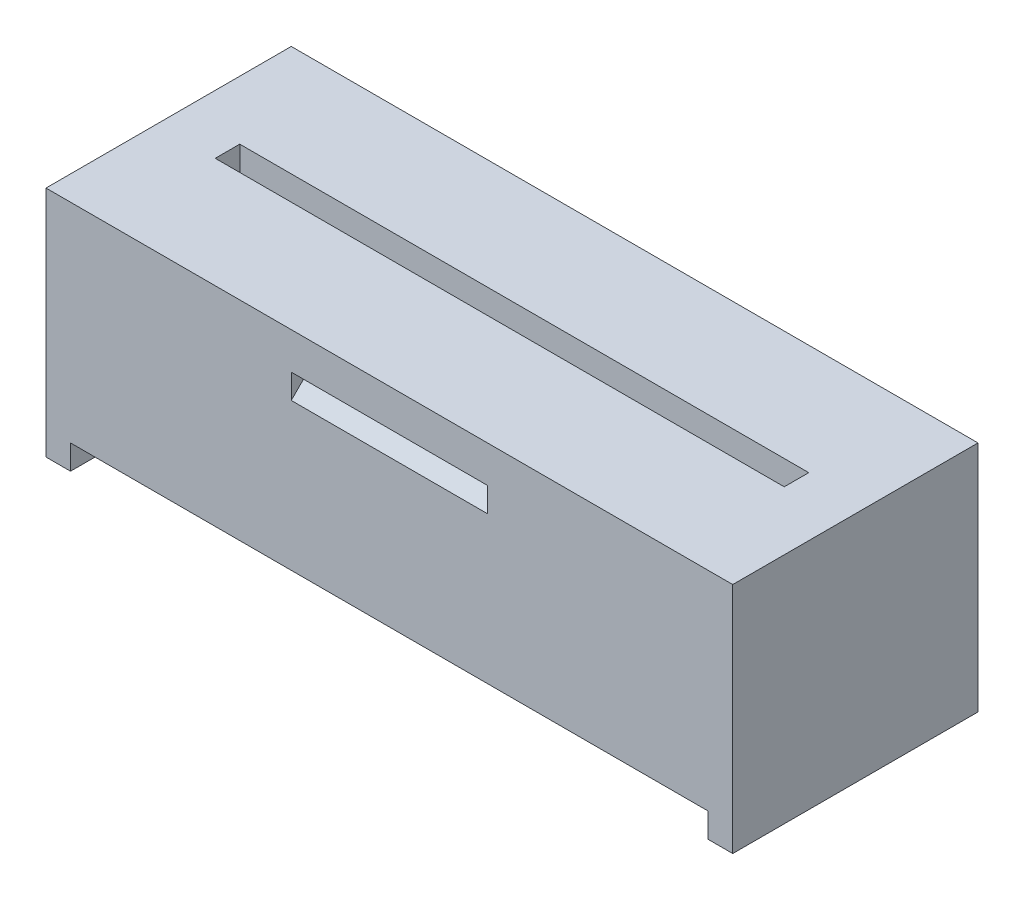
ISO-10303-21;
HEADER;
FILE_DESCRIPTION(('STEP AP214'),'2;1');
FILE_NAME('part.step','',(''),(''),'','','');
FILE_SCHEMA(('AUTOMOTIVE_DESIGN { 1 0 10303 214 1 1 1 1 }'));
ENDSEC;
DATA;
#1=APPLICATION_CONTEXT('core data for automotive mechanical design processes');
#2=APPLICATION_PROTOCOL_DEFINITION('international standard','automotive_design',2000,#1);
#3=PRODUCT_CONTEXT('',#1,'mechanical');
#4=PRODUCT('Part','Part','',(#3));
#5=PRODUCT_RELATED_PRODUCT_CATEGORY('part','',(#4));
#6=PRODUCT_DEFINITION_FORMATION('','',#4);
#7=PRODUCT_DEFINITION_CONTEXT('part definition',#1,'design');
#8=PRODUCT_DEFINITION('design','',#6,#7);
#9=PRODUCT_DEFINITION_SHAPE('','',#8);
#10=(LENGTH_UNIT() NAMED_UNIT(*) SI_UNIT(.MILLI.,.METRE.));
#11=(NAMED_UNIT(*) PLANE_ANGLE_UNIT() SI_UNIT($,.RADIAN.));
#12=(NAMED_UNIT(*) SI_UNIT($,.STERADIAN.) SOLID_ANGLE_UNIT());
#13=UNCERTAINTY_MEASURE_WITH_UNIT(LENGTH_MEASURE(1.E-05),#10,'distance_accuracy_value','');
#14=(GEOMETRIC_REPRESENTATION_CONTEXT(3) GLOBAL_UNCERTAINTY_ASSIGNED_CONTEXT((#13)) GLOBAL_UNIT_ASSIGNED_CONTEXT((#10,
#11,#12)) REPRESENTATION_CONTEXT('',''));
#15=CARTESIAN_POINT('',(0.,0.,0.));
#16=DIRECTION('',(0.,0.,1.));
#17=DIRECTION('',(1.,0.,0.));
#18=AXIS2_PLACEMENT_3D('',#15,#16,#17);
#19=CARTESIAN_POINT('',(0.,0.,0.));
#20=DIRECTION('',(0.,0.,1.));
#21=DIRECTION('',(1.,0.,0.));
#22=AXIS2_PLACEMENT_3D('',#19,#20,#21);
#23=PLANE('',#22);
#24=DIRECTION('',(0.,-1.,0.));
#25=VECTOR('',#24,1.);
#26=CARTESIAN_POINT('',(-18.6567442914303,1.7852950239775,0.));
#27=LINE('',#26,#25);
#28=CARTESIAN_POINT('',(-18.6567442914303,1.7852950239775,0.));
#29=VERTEX_POINT('',#28);
#30=CARTESIAN_POINT('',(-18.6567442914303,-7.7147049760225,0.));
#31=VERTEX_POINT('',#30);
#32=EDGE_CURVE('E346',#29,#31,#27,.T.);
#33=ORIENTED_EDGE('',*,*,#32,.T.);
#34=DIRECTION('',(1.,0.,0.));
#35=VECTOR('',#34,1.);
#36=CARTESIAN_POINT('',(-18.6567442914303,-7.7147049760225,0.));
#37=LINE('',#36,#35);
#38=CARTESIAN_POINT('',(-19.6567442914303,-7.7147049760225,0.));
#39=VERTEX_POINT('',#38);
#40=EDGE_CURVE('E274',#39,#31,#37,.T.);
#41=ORIENTED_EDGE('',*,*,#40,.F.);
#42=DIRECTION('',(0.,1.,0.));
#43=VECTOR('',#42,1.);
#44=CARTESIAN_POINT('',(-19.6567442914303,-7.7147049760225,0.));
#45=LINE('',#44,#43);
#46=CARTESIAN_POINT('',(-19.6567442914303,-6.7147049760225,0.));
#47=VERTEX_POINT('',#46);
#48=EDGE_CURVE('E277',#39,#47,#45,.T.);
#49=ORIENTED_EDGE('',*,*,#48,.T.);
#50=DIRECTION('',(1.,0.,0.));
#51=VECTOR('',#50,1.);
#52=CARTESIAN_POINT('',(-46.6567442914303,-6.7147049760225,0.));
#53=LINE('',#52,#51);
#54=CARTESIAN_POINT('',(-45.6567442914303,-6.7147049760225,0.));
#55=VERTEX_POINT('',#54);
#56=EDGE_CURVE('E387',#55,#47,#53,.T.);
#57=ORIENTED_EDGE('',*,*,#56,.F.);
#58=DIRECTION('',(0.,1.,0.));
#59=VECTOR('',#58,1.);
#60=CARTESIAN_POINT('',(-45.6567442914303,-7.7147049760225,0.));
#61=LINE('',#60,#59);
#62=CARTESIAN_POINT('',(-45.6567442914303,-7.7147049760225,0.));
#63=VERTEX_POINT('',#62);
#64=EDGE_CURVE('E301',#63,#55,#61,.T.);
#65=ORIENTED_EDGE('',*,*,#64,.F.);
#66=DIRECTION('',(1.,0.,0.));
#67=VECTOR('',#66,1.);
#68=CARTESIAN_POINT('',(-46.6567442914303,-7.7147049760225,0.));
#69=LINE('',#68,#67);
#70=CARTESIAN_POINT('',(-46.6567442914303,-7.7147049760225,0.));
#71=VERTEX_POINT('',#70);
#72=EDGE_CURVE('E289',#71,#63,#69,.T.);
#73=ORIENTED_EDGE('',*,*,#72,.F.);
#74=DIRECTION('',(0.,-1.,0.));
#75=VECTOR('',#74,1.);
#76=CARTESIAN_POINT('',(-46.6567442914303,1.7852950239775,0.));
#77=LINE('',#76,#75);
#78=CARTESIAN_POINT('',(-46.6567442914303,1.7852950239775,0.));
#79=VERTEX_POINT('',#78);
#80=EDGE_CURVE('E389',#79,#71,#77,.T.);
#81=ORIENTED_EDGE('',*,*,#80,.F.);
#82=DIRECTION('',(-1.,0.,0.));
#83=VECTOR('',#82,1.);
#84=CARTESIAN_POINT('',(-18.6567442914303,1.7852950239775,0.));
#85=LINE('',#84,#83);
#86=EDGE_CURVE('E379',#29,#79,#85,.T.);
#87=ORIENTED_EDGE('',*,*,#86,.F.);
#88=EDGE_LOOP('',(#33,#41,#49,#57,#65,#73,#81,#87));
#89=FACE_BOUND('',#88,.T.);
#90=DIRECTION('',(0.,1.,0.));
#91=VECTOR('',#90,1.);
#92=CARTESIAN_POINT('',(-36.6567442914303,-0.714704976022495,0.));
#93=LINE('',#92,#91);
#94=CARTESIAN_POINT('',(-36.6567442914303,-0.714704976022495,0.));
#95=VERTEX_POINT('',#94);
#96=CARTESIAN_POINT('',(-36.6567442914303,0.285295023977495,0.));
#97=VERTEX_POINT('',#96);
#98=EDGE_CURVE('E243',#95,#97,#93,.T.);
#99=ORIENTED_EDGE('',*,*,#98,.F.);
#100=DIRECTION('',(1.,0.,0.));
#101=VECTOR('',#100,1.);
#102=CARTESIAN_POINT('',(-36.6567442914303,-0.714704976022495,0.));
#103=LINE('',#102,#101);
#104=CARTESIAN_POINT('',(-28.6567442914303,-0.714704976022495,0.));
#105=VERTEX_POINT('',#104);
#106=EDGE_CURVE('E260',#95,#105,#103,.T.);
#107=ORIENTED_EDGE('',*,*,#106,.T.);
#108=DIRECTION('',(0.,1.,0.));
#109=VECTOR('',#108,1.);
#110=CARTESIAN_POINT('',(-28.6567442914303,-0.714704976022495,0.));
#111=LINE('',#110,#109);
#112=CARTESIAN_POINT('',(-28.6567442914303,0.285295023977495,0.));
#113=VERTEX_POINT('',#112);
#114=EDGE_CURVE('E254',#105,#113,#111,.T.);
#115=ORIENTED_EDGE('',*,*,#114,.T.);
#116=DIRECTION('',(1.,0.,0.));
#117=VECTOR('',#116,1.);
#118=CARTESIAN_POINT('',(-36.6567442914303,0.285295023977495,0.));
#119=LINE('',#118,#117);
#120=EDGE_CURVE('E253',#97,#113,#119,.T.);
#121=ORIENTED_EDGE('',*,*,#120,.F.);
#122=EDGE_LOOP('',(#99,#107,#115,#121));
#123=FACE_BOUND('',#122,.T.);
#124=ADVANCED_FACE('F33',(#89,#123),#23,.F.);
#125=CARTESIAN_POINT('',(-46.6567442914303,-6.7147049760225,10.));
#126=DIRECTION('',(0.,1.,0.));
#127=DIRECTION('',(0.,0.,1.));
#128=AXIS2_PLACEMENT_3D('',#125,#126,#127);
#129=PLANE('',#128);
#130=CARTESIAN_POINT('',(-41.6567442914303,-6.7147049760225,5.));
#131=DIRECTION('',(0.,-1.,0.));
#132=DIRECTION('',(0.,0.,-1.));
#133=AXIS2_PLACEMENT_3D('',#130,#131,#132);
#134=CIRCLE('',#133,2.6);
#135=CARTESIAN_POINT('',(-41.6567442914303,-6.7147049760225,2.4));
#136=VERTEX_POINT('',#135);
#137=EDGE_CURVE('E349',#136,#136,#134,.T.);
#138=ORIENTED_EDGE('',*,*,#137,.F.);
#139=EDGE_LOOP('',(#138));
#140=FACE_BOUND('',#139,.T.);
#141=CARTESIAN_POINT('',(-35.6467442914303,-6.7147049760225,5.00000000000004));
#142=DIRECTION('',(0.,-1.,0.));
#143=DIRECTION('',(0.,0.,-1.));
#144=AXIS2_PLACEMENT_3D('',#141,#142,#143);
#145=CIRCLE('',#144,2.6);
#146=CARTESIAN_POINT('',(-35.6467442914303,-6.7147049760225,2.40000000000004));
#147=VERTEX_POINT('',#146);
#148=EDGE_CURVE('E356',#147,#147,#145,.T.);
#149=ORIENTED_EDGE('',*,*,#148,.F.);
#150=EDGE_LOOP('',(#149));
#151=FACE_BOUND('',#150,.T.);
#152=CARTESIAN_POINT('',(-29.6367442914303,-6.7147049760225,5.00000000000008));
#153=DIRECTION('',(0.,-1.,0.));
#154=DIRECTION('',(0.,0.,-1.));
#155=AXIS2_PLACEMENT_3D('',#152,#153,#154);
#156=CIRCLE('',#155,2.6);
#157=CARTESIAN_POINT('',(-29.6367442914303,-6.7147049760225,2.40000000000008));
#158=VERTEX_POINT('',#157);
#159=EDGE_CURVE('E364',#158,#158,#156,.T.);
#160=ORIENTED_EDGE('',*,*,#159,.F.);
#161=EDGE_LOOP('',(#160));
#162=FACE_BOUND('',#161,.T.);
#163=CARTESIAN_POINT('',(-23.6267442914303,-6.7147049760225,5.00000000000013));
#164=DIRECTION('',(0.,-1.,0.));
#165=DIRECTION('',(0.,0.,-1.));
#166=AXIS2_PLACEMENT_3D('',#163,#164,#165);
#167=CIRCLE('',#166,2.6);
#168=CARTESIAN_POINT('',(-23.6267442914303,-6.7147049760225,2.40000000000013));
#169=VERTEX_POINT('',#168);
#170=EDGE_CURVE('E372',#169,#169,#167,.T.);
#171=ORIENTED_EDGE('',*,*,#170,.F.);
#172=EDGE_LOOP('',(#171));
#173=FACE_BOUND('',#172,.T.);
#174=DIRECTION('',(0.,0.,-1.));
#175=VECTOR('',#174,1.);
#176=CARTESIAN_POINT('',(-19.6567442914303,-6.7147049760225,10.));
#177=LINE('',#176,#175);
#178=CARTESIAN_POINT('',(-19.6567442914303,-6.7147049760225,10.));
#179=VERTEX_POINT('',#178);
#180=EDGE_CURVE('E270',#179,#47,#177,.T.);
#181=ORIENTED_EDGE('',*,*,#180,.F.);
#182=DIRECTION('',(1.,0.,0.));
#183=VECTOR('',#182,1.);
#184=CARTESIAN_POINT('',(-46.6567442914303,-6.7147049760225,10.));
#185=LINE('',#184,#183);
#186=CARTESIAN_POINT('',(-45.6567442914303,-6.7147049760225,10.));
#187=VERTEX_POINT('',#186);
#188=EDGE_CURVE('E378',#187,#179,#185,.T.);
#189=ORIENTED_EDGE('',*,*,#188,.F.);
#190=DIRECTION('',(0.,0.,1.));
#191=VECTOR('',#190,1.);
#192=CARTESIAN_POINT('',(-45.6567442914303,-6.7147049760225,10.));
#193=LINE('',#192,#191);
#194=EDGE_CURVE('E285',#55,#187,#193,.T.);
#195=ORIENTED_EDGE('',*,*,#194,.F.);
#196=ORIENTED_EDGE('',*,*,#56,.T.);
#197=EDGE_LOOP('',(#181,#189,#195,#196));
#198=FACE_BOUND('',#197,.T.);
#199=ADVANCED_FACE('F428',(#140,#151,#162,#173,#198),#129,.F.);
#200=CARTESIAN_POINT('',(-23.6267442914303,0.785295023977495,5.00000000000013));
#201=DIRECTION('',(0.,-1.,0.));
#202=DIRECTION('',(0.,0.,-1.));
#203=AXIS2_PLACEMENT_3D('',#200,#201,#202);
#204=PLANE('',#203);
#205=CARTESIAN_POINT('',(-23.6267442914303,0.785295023977495,5.00000000000013));
#206=DIRECTION('',(0.,-1.,0.));
#207=DIRECTION('',(0.,0.,-1.));
#208=AXIS2_PLACEMENT_3D('',#205,#206,#207);
#209=CIRCLE('',#208,2.6);
#210=CARTESIAN_POINT('',(-21.0567442914303,0.785295023977499,4.60617262664985));
#211=VERTEX_POINT('',#210);
#212=CARTESIAN_POINT('',(-21.0567442914303,0.785295023977499,5.39382737335041));
#213=VERTEX_POINT('',#212);
#214=EDGE_CURVE('E369',#211,#213,#209,.T.);
#215=ORIENTED_EDGE('',*,*,#214,.T.);
#216=DIRECTION('',(0.,0.,-1.));
#217=VECTOR('',#216,1.);
#218=CARTESIAN_POINT('',(-21.0567442914303,0.785295023977499,4.5));
#219=LINE('',#218,#217);
#220=EDGE_CURVE('E309',#213,#211,#219,.T.);
#221=ORIENTED_EDGE('',*,*,#220,.T.);
#222=EDGE_LOOP('',(#215,#221));
#223=FACE_BOUND('',#222,.T.);
#224=ADVANCED_FACE('F430',(#223),#204,.T.);
#225=CARTESIAN_POINT('',(-21.0752741269957,0.785295023977499,5.5));
#226=VERTEX_POINT('',#225);
#227=CARTESIAN_POINT('',(-26.178214455865,0.785295023977498,5.5));
#228=VERTEX_POINT('',#227);
#229=EDGE_CURVE('E875',#226,#228,#209,.T.);
#230=ORIENTED_EDGE('',*,*,#229,.T.);
#231=DIRECTION('',(1.,0.,0.));
#232=VECTOR('',#231,1.);
#233=CARTESIAN_POINT('',(-44.2567442914303,0.785295023977495,5.5));
#234=LINE('',#233,#232);
#235=EDGE_CURVE('E905',#228,#226,#234,.T.);
#236=ORIENTED_EDGE('',*,*,#235,.T.);
#237=EDGE_LOOP('',(#230,#236));
#238=FACE_BOUND('',#237,.T.);
#239=ADVANCED_FACE('F436',(#238),#204,.T.);
#240=CARTESIAN_POINT('',(-26.1782144558649,0.785295023977494,4.5));
#241=VERTEX_POINT('',#240);
#242=CARTESIAN_POINT('',(-21.0752741269957,0.785295023977499,4.5));
#243=VERTEX_POINT('',#242);
#244=EDGE_CURVE('E370',#241,#243,#209,.T.);
#245=ORIENTED_EDGE('',*,*,#244,.T.);
#246=DIRECTION('',(-1.,0.,0.));
#247=VECTOR('',#246,1.);
#248=CARTESIAN_POINT('',(-44.2567442914303,0.785295023977495,4.5));
#249=LINE('',#248,#247);
#250=EDGE_CURVE('E315',#243,#241,#249,.T.);
#251=ORIENTED_EDGE('',*,*,#250,.T.);
#252=EDGE_LOOP('',(#245,#251));
#253=FACE_BOUND('',#252,.T.);
#254=ADVANCED_FACE('F439',(#253),#204,.T.);
#255=CARTESIAN_POINT('',(-29.6367442914303,0.785295023977495,5.00000000000008));
#256=DIRECTION('',(0.,-1.,0.));
#257=DIRECTION('',(0.,0.,-1.));
#258=AXIS2_PLACEMENT_3D('',#255,#256,#257);
#259=PLANE('',#258);
#260=CARTESIAN_POINT('',(-29.6367442914303,0.785295023977495,5.00000000000008));
#261=DIRECTION('',(0.,-1.,0.));
#262=DIRECTION('',(0.,0.,-1.));
#263=AXIS2_PLACEMENT_3D('',#260,#261,#262);
#264=CIRCLE('',#263,2.6);
#265=CARTESIAN_POINT('',(-27.0852741269957,0.785295023977498,5.5));
#266=VERTEX_POINT('',#265);
#267=CARTESIAN_POINT('',(-32.188214455865,0.785295023977497,5.5));
#268=VERTEX_POINT('',#267);
#269=EDGE_CURVE('E361',#266,#268,#264,.T.);
#270=ORIENTED_EDGE('',*,*,#269,.T.);
#271=EDGE_CURVE('E903',#268,#266,#234,.T.);
#272=ORIENTED_EDGE('',*,*,#271,.T.);
#273=EDGE_LOOP('',(#270,#272));
#274=FACE_BOUND('',#273,.T.);
#275=ADVANCED_FACE('F460',(#274),#259,.T.);
#276=CARTESIAN_POINT('',(-32.1882144558649,0.785295023977494,4.5));
#277=VERTEX_POINT('',#276);
#278=CARTESIAN_POINT('',(-27.0852741269957,0.785295023977498,4.5));
#279=VERTEX_POINT('',#278);
#280=EDGE_CURVE('E362',#277,#279,#264,.T.);
#281=ORIENTED_EDGE('',*,*,#280,.T.);
#282=EDGE_CURVE('E898',#279,#277,#249,.T.);
#283=ORIENTED_EDGE('',*,*,#282,.T.);
#284=EDGE_LOOP('',(#281,#283));
#285=FACE_BOUND('',#284,.T.);
#286=ADVANCED_FACE('F463',(#285),#259,.T.);
#287=CARTESIAN_POINT('',(-35.6467442914303,0.785295023977495,5.00000000000004));
#288=DIRECTION('',(0.,-1.,0.));
#289=DIRECTION('',(0.,0.,-1.));
#290=AXIS2_PLACEMENT_3D('',#287,#288,#289);
#291=PLANE('',#290);
#292=CARTESIAN_POINT('',(-35.6467442914303,0.785295023977495,5.00000000000004));
#293=DIRECTION('',(0.,-1.,0.));
#294=DIRECTION('',(0.,0.,-1.));
#295=AXIS2_PLACEMENT_3D('',#292,#293,#294);
#296=CIRCLE('',#295,2.6);
#297=CARTESIAN_POINT('',(-33.0952741269957,0.785295023977497,5.5));
#298=VERTEX_POINT('',#297);
#299=CARTESIAN_POINT('',(-38.1982144558649,0.785295023977496,5.5));
#300=VERTEX_POINT('',#299);
#301=EDGE_CURVE('E354',#298,#300,#296,.T.);
#302=ORIENTED_EDGE('',*,*,#301,.T.);
#303=EDGE_CURVE('E854',#300,#298,#234,.T.);
#304=ORIENTED_EDGE('',*,*,#303,.T.);
#305=EDGE_LOOP('',(#302,#304));
#306=FACE_BOUND('',#305,.T.);
#307=ADVANCED_FACE('F469',(#306),#291,.T.);
#308=CARTESIAN_POINT('',(-38.1982144558649,0.785295023977494,4.5));
#309=VERTEX_POINT('',#308);
#310=CARTESIAN_POINT('',(-33.0952741269957,0.785295023977497,4.5));
#311=VERTEX_POINT('',#310);
#312=EDGE_CURVE('E355',#309,#311,#296,.T.);
#313=ORIENTED_EDGE('',*,*,#312,.T.);
#314=EDGE_CURVE('E914',#311,#309,#249,.T.);
#315=ORIENTED_EDGE('',*,*,#314,.T.);
#316=EDGE_LOOP('',(#313,#315));
#317=FACE_BOUND('',#316,.T.);
#318=ADVANCED_FACE('F472',(#317),#291,.T.);
#319=CARTESIAN_POINT('',(-41.6567442914303,0.785295023977495,5.));
#320=DIRECTION('',(0.,-1.,0.));
#321=DIRECTION('',(0.,0.,-1.));
#322=AXIS2_PLACEMENT_3D('',#319,#320,#321);
#323=PLANE('',#322);
#324=CARTESIAN_POINT('',(-41.6567442914303,0.785295023977495,5.));
#325=DIRECTION('',(0.,-1.,0.));
#326=DIRECTION('',(0.,0.,-1.));
#327=AXIS2_PLACEMENT_3D('',#324,#325,#326);
#328=CIRCLE('',#327,2.6);
#329=CARTESIAN_POINT('',(-39.1052741269957,0.785295023977496,5.5));
#330=VERTEX_POINT('',#329);
#331=CARTESIAN_POINT('',(-44.2082144558649,0.785295023977495,5.5));
#332=VERTEX_POINT('',#331);
#333=EDGE_CURVE('E347',#330,#332,#328,.T.);
#334=ORIENTED_EDGE('',*,*,#333,.T.);
#335=EDGE_CURVE('E324',#332,#330,#234,.T.);
#336=ORIENTED_EDGE('',*,*,#335,.T.);
#337=EDGE_LOOP('',(#334,#336));
#338=FACE_BOUND('',#337,.T.);
#339=ADVANCED_FACE('F478',(#338),#323,.T.);
#340=CARTESIAN_POINT('',(-44.2082144558649,0.785295023977494,4.5));
#341=VERTEX_POINT('',#340);
#342=CARTESIAN_POINT('',(-39.1052741269957,0.785295023977496,4.5));
#343=VERTEX_POINT('',#342);
#344=EDGE_CURVE('E348',#341,#343,#328,.T.);
#345=ORIENTED_EDGE('',*,*,#344,.T.);
#346=EDGE_CURVE('E836',#343,#341,#249,.T.);
#347=ORIENTED_EDGE('',*,*,#346,.T.);
#348=EDGE_LOOP('',(#345,#347));
#349=FACE_BOUND('',#348,.T.);
#350=ADVANCED_FACE('F481',(#349),#323,.T.);
#351=CARTESIAN_POINT('',(-18.6567442914303,1.7852950239775,10.));
#352=DIRECTION('',(1.,0.,0.));
#353=DIRECTION('',(0.,0.,-1.));
#354=AXIS2_PLACEMENT_3D('',#351,#352,#353);
#355=PLANE('',#354);
#356=ORIENTED_EDGE('',*,*,#32,.F.);
#357=DIRECTION('',(0.,0.,-1.));
#358=VECTOR('',#357,1.);
#359=CARTESIAN_POINT('',(-18.6567442914303,1.7852950239775,10.));
#360=LINE('',#359,#358);
#361=CARTESIAN_POINT('',(-18.6567442914303,1.7852950239775,10.));
#362=VERTEX_POINT('',#361);
#363=EDGE_CURVE('E11',#362,#29,#360,.T.);
#364=ORIENTED_EDGE('',*,*,#363,.F.);
#365=DIRECTION('',(0.,-1.,0.));
#366=VECTOR('',#365,1.);
#367=CARTESIAN_POINT('',(-18.6567442914303,1.7852950239775,10.));
#368=LINE('',#367,#366);
#369=CARTESIAN_POINT('',(-18.6567442914303,-7.7147049760225,10.));
#370=VERTEX_POINT('',#369);
#371=EDGE_CURVE('E376',#362,#370,#368,.T.);
#372=ORIENTED_EDGE('',*,*,#371,.T.);
#373=DIRECTION('',(0.,0.,1.));
#374=VECTOR('',#373,1.);
#375=CARTESIAN_POINT('',(-18.6567442914303,-7.7147049760225,10.));
#376=LINE('',#375,#374);
#377=EDGE_CURVE('E266',#31,#370,#376,.T.);
#378=ORIENTED_EDGE('',*,*,#377,.F.);
#379=EDGE_LOOP('',(#356,#364,#372,#378));
#380=FACE_BOUND('',#379,.T.);
#381=ADVANCED_FACE('F35',(#380),#355,.T.);
#382=CARTESIAN_POINT('',(-18.6567442914303,1.7852950239775,10.));
#383=DIRECTION('',(0.,-1.,0.));
#384=DIRECTION('',(1.,0.,0.));
#385=AXIS2_PLACEMENT_3D('',#382,#383,#384);
#386=PLANE('',#385);
#387=DIRECTION('',(-1.,0.,0.));
#388=VECTOR('',#387,1.);
#389=CARTESIAN_POINT('',(-44.2567442914303,1.7852950239775,4.5));
#390=LINE('',#389,#388);
#391=CARTESIAN_POINT('',(-21.0567442914303,1.7852950239775,4.5));
#392=VERTEX_POINT('',#391);
#393=CARTESIAN_POINT('',(-44.2567442914303,1.7852950239775,4.5));
#394=VERTEX_POINT('',#393);
#395=EDGE_CURVE('E326',#392,#394,#390,.T.);
#396=ORIENTED_EDGE('',*,*,#395,.F.);
#397=DIRECTION('',(0.,0.,-1.));
#398=VECTOR('',#397,1.);
#399=CARTESIAN_POINT('',(-21.0567442914303,1.7852950239775,4.5));
#400=LINE('',#399,#398);
#401=CARTESIAN_POINT('',(-21.0567442914303,1.7852950239775,5.5));
#402=VERTEX_POINT('',#401);
#403=EDGE_CURVE('E304',#402,#392,#400,.T.);
#404=ORIENTED_EDGE('',*,*,#403,.F.);
#405=DIRECTION('',(1.,0.,0.));
#406=VECTOR('',#405,1.);
#407=CARTESIAN_POINT('',(-44.2567442914303,1.7852950239775,5.5));
#408=LINE('',#407,#406);
#409=CARTESIAN_POINT('',(-44.2567442914303,1.7852950239775,5.5));
#410=VERTEX_POINT('',#409);
#411=EDGE_CURVE('E332',#410,#402,#408,.T.);
#412=ORIENTED_EDGE('',*,*,#411,.F.);
#413=DIRECTION('',(0.,0.,1.));
#414=VECTOR('',#413,1.);
#415=CARTESIAN_POINT('',(-44.2567442914303,1.7852950239775,4.5));
#416=LINE('',#415,#414);
#417=EDGE_CURVE('E329',#394,#410,#416,.T.);
#418=ORIENTED_EDGE('',*,*,#417,.F.);
#419=EDGE_LOOP('',(#396,#404,#412,#418));
#420=FACE_BOUND('',#419,.T.);
#421=ORIENTED_EDGE('',*,*,#86,.T.);
#422=DIRECTION('',(0.,0.,-1.));
#423=VECTOR('',#422,1.);
#424=CARTESIAN_POINT('',(-46.6567442914303,1.7852950239775,10.));
#425=LINE('',#424,#423);
#426=CARTESIAN_POINT('',(-46.6567442914303,1.7852950239775,10.));
#427=VERTEX_POINT('',#426);
#428=EDGE_CURVE('E37',#427,#79,#425,.T.);
#429=ORIENTED_EDGE('',*,*,#428,.F.);
#430=DIRECTION('',(-1.,0.,0.));
#431=VECTOR('',#430,1.);
#432=CARTESIAN_POINT('',(-18.6567442914303,1.7852950239775,10.));
#433=LINE('',#432,#431);
#434=EDGE_CURVE('E384',#362,#427,#433,.T.);
#435=ORIENTED_EDGE('',*,*,#434,.F.);
#436=ORIENTED_EDGE('',*,*,#363,.T.);
#437=EDGE_LOOP('',(#421,#429,#435,#436));
#438=FACE_BOUND('',#437,.T.);
#439=ADVANCED_FACE('F395',(#420,#438),#386,.F.);
#440=CARTESIAN_POINT('',(-46.6567442914303,1.7852950239775,10.));
#441=DIRECTION('',(1.,0.,0.));
#442=DIRECTION('',(0.,0.,-1.));
#443=AXIS2_PLACEMENT_3D('',#440,#441,#442);
#444=PLANE('',#443);
#445=ORIENTED_EDGE('',*,*,#80,.T.);
#446=DIRECTION('',(0.,0.,-1.));
#447=VECTOR('',#446,1.);
#448=CARTESIAN_POINT('',(-46.6567442914303,-7.7147049760225,10.));
#449=LINE('',#448,#447);
#450=CARTESIAN_POINT('',(-46.6567442914303,-7.7147049760225,10.));
#451=VERTEX_POINT('',#450);
#452=EDGE_CURVE('E286',#451,#71,#449,.T.);
#453=ORIENTED_EDGE('',*,*,#452,.F.);
#454=DIRECTION('',(0.,-1.,0.));
#455=VECTOR('',#454,1.);
#456=CARTESIAN_POINT('',(-46.6567442914303,1.7852950239775,10.));
#457=LINE('',#456,#455);
#458=EDGE_CURVE('E382',#427,#451,#457,.T.);
#459=ORIENTED_EDGE('',*,*,#458,.F.);
#460=ORIENTED_EDGE('',*,*,#428,.T.);
#461=EDGE_LOOP('',(#445,#453,#459,#460));
#462=FACE_BOUND('',#461,.T.);
#463=ADVANCED_FACE('F402',(#462),#444,.F.);
#464=CARTESIAN_POINT('',(0.,0.,10.));
#465=DIRECTION('',(0.,0.,1.));
#466=DIRECTION('',(1.,0.,0.));
#467=AXIS2_PLACEMENT_3D('',#464,#465,#466);
#468=PLANE('',#467);
#469=DIRECTION('',(0.,-1.,0.));
#470=VECTOR('',#469,1.);
#471=CARTESIAN_POINT('',(-36.6567442914303,-0.714704976022505,10.));
#472=LINE('',#471,#470);
#473=CARTESIAN_POINT('',(-36.6567442914303,0.285295023977495,10.));
#474=VERTEX_POINT('',#473);
#475=CARTESIAN_POINT('',(-36.6567442914303,-0.714704976022505,10.));
#476=VERTEX_POINT('',#475);
#477=EDGE_CURVE('E226',#474,#476,#472,.T.);
#478=ORIENTED_EDGE('',*,*,#477,.F.);
#479=DIRECTION('',(1.,0.,0.));
#480=VECTOR('',#479,1.);
#481=CARTESIAN_POINT('',(-36.6567442914303,0.285295023977495,10.));
#482=LINE('',#481,#480);
#483=CARTESIAN_POINT('',(-28.6567442914303,0.285295023977495,10.));
#484=VERTEX_POINT('',#483);
#485=EDGE_CURVE('E238',#474,#484,#482,.T.);
#486=ORIENTED_EDGE('',*,*,#485,.T.);
#487=DIRECTION('',(0.,-1.,0.));
#488=VECTOR('',#487,1.);
#489=CARTESIAN_POINT('',(-28.6567442914303,-0.714704976022505,10.));
#490=LINE('',#489,#488);
#491=CARTESIAN_POINT('',(-28.6567442914303,-0.714704976022505,10.));
#492=VERTEX_POINT('',#491);
#493=EDGE_CURVE('E236',#484,#492,#490,.T.);
#494=ORIENTED_EDGE('',*,*,#493,.T.);
#495=DIRECTION('',(1.,0.,0.));
#496=VECTOR('',#495,1.);
#497=CARTESIAN_POINT('',(-36.6567442914303,-0.714704976022505,10.));
#498=LINE('',#497,#496);
#499=EDGE_CURVE('E219',#476,#492,#498,.T.);
#500=ORIENTED_EDGE('',*,*,#499,.F.);
#501=EDGE_LOOP('',(#478,#486,#494,#500));
#502=FACE_BOUND('',#501,.T.);
#503=ORIENTED_EDGE('',*,*,#371,.F.);
#504=ORIENTED_EDGE('',*,*,#434,.T.);
#505=ORIENTED_EDGE('',*,*,#458,.T.);
#506=DIRECTION('',(-1.,0.,0.));
#507=VECTOR('',#506,1.);
#508=CARTESIAN_POINT('',(-46.6567442914303,-7.7147049760225,10.));
#509=LINE('',#508,#507);
#510=CARTESIAN_POINT('',(-45.6567442914303,-7.7147049760225,10.));
#511=VERTEX_POINT('',#510);
#512=EDGE_CURVE('E293',#511,#451,#509,.T.);
#513=ORIENTED_EDGE('',*,*,#512,.F.);
#514=DIRECTION('',(0.,1.,0.));
#515=VECTOR('',#514,1.);
#516=CARTESIAN_POINT('',(-45.6567442914303,-7.7147049760225,10.));
#517=LINE('',#516,#515);
#518=EDGE_CURVE('E296',#511,#187,#517,.T.);
#519=ORIENTED_EDGE('',*,*,#518,.T.);
#520=ORIENTED_EDGE('',*,*,#188,.T.);
#521=DIRECTION('',(0.,1.,0.));
#522=VECTOR('',#521,1.);
#523=CARTESIAN_POINT('',(-19.6567442914303,-7.7147049760225,10.));
#524=LINE('',#523,#522);
#525=CARTESIAN_POINT('',(-19.6567442914303,-7.7147049760225,10.));
#526=VERTEX_POINT('',#525);
#527=EDGE_CURVE('E282',#526,#179,#524,.T.);
#528=ORIENTED_EDGE('',*,*,#527,.F.);
#529=DIRECTION('',(-1.,0.,0.));
#530=VECTOR('',#529,1.);
#531=CARTESIAN_POINT('',(-18.6567442914303,-7.7147049760225,10.));
#532=LINE('',#531,#530);
#533=EDGE_CURVE('E269',#370,#526,#532,.T.);
#534=ORIENTED_EDGE('',*,*,#533,.F.);
#535=EDGE_LOOP('',(#503,#504,#505,#513,#519,#520,#528,#534));
#536=FACE_BOUND('',#535,.T.);
#537=ADVANCED_FACE('F234',(#502,#536),#468,.T.);
#538=CARTESIAN_POINT('',(-23.6267442914303,0.785295023977495,5.00000000000013));
#539=DIRECTION('',(0.,-1.,0.));
#540=DIRECTION('',(0.,0.,-1.));
#541=AXIS2_PLACEMENT_3D('',#538,#539,#540);
#542=CYLINDRICAL_SURFACE('',#541,2.6);
#543=EDGE_CURVE('E367',#243,#211,#209,.T.);
#544=ORIENTED_EDGE('',*,*,#543,.F.);
#545=ORIENTED_EDGE('',*,*,#244,.F.);
#546=EDGE_CURVE('E371',#228,#241,#209,.T.);
#547=ORIENTED_EDGE('',*,*,#546,.F.);
#548=ORIENTED_EDGE('',*,*,#229,.F.);
#549=EDGE_CURVE('E375',#213,#226,#209,.T.);
#550=ORIENTED_EDGE('',*,*,#549,.F.);
#551=ORIENTED_EDGE('',*,*,#214,.F.);
#552=EDGE_LOOP('',(#544,#545,#547,#548,#550,#551));
#553=FACE_BOUND('',#552,.T.);
#554=ORIENTED_EDGE('',*,*,#170,.T.);
#555=EDGE_LOOP('',(#554));
#556=FACE_BOUND('',#555,.T.);
#557=ADVANCED_FACE('F451',(#553,#556),#542,.F.);
#558=CARTESIAN_POINT('',(-29.6367442914303,0.785295023977495,5.00000000000008));
#559=DIRECTION('',(0.,-1.,0.));
#560=DIRECTION('',(0.,0.,-1.));
#561=AXIS2_PLACEMENT_3D('',#558,#559,#560);
#562=CYLINDRICAL_SURFACE('',#561,2.6);
#563=EDGE_CURVE('E359',#279,#266,#264,.T.);
#564=ORIENTED_EDGE('',*,*,#563,.F.);
#565=ORIENTED_EDGE('',*,*,#280,.F.);
#566=EDGE_CURVE('E363',#268,#277,#264,.T.);
#567=ORIENTED_EDGE('',*,*,#566,.F.);
#568=ORIENTED_EDGE('',*,*,#269,.F.);
#569=EDGE_LOOP('',(#564,#565,#567,#568));
#570=FACE_BOUND('',#569,.T.);
#571=ORIENTED_EDGE('',*,*,#159,.T.);
#572=EDGE_LOOP('',(#571));
#573=FACE_BOUND('',#572,.T.);
#574=ADVANCED_FACE('F453',(#570,#573),#562,.F.);
#575=CARTESIAN_POINT('',(-35.6467442914303,0.785295023977495,5.00000000000004));
#576=DIRECTION('',(0.,-1.,0.));
#577=DIRECTION('',(0.,0.,-1.));
#578=AXIS2_PLACEMENT_3D('',#575,#576,#577);
#579=CYLINDRICAL_SURFACE('',#578,2.6);
#580=EDGE_CURVE('E352',#311,#298,#296,.T.);
#581=ORIENTED_EDGE('',*,*,#580,.F.);
#582=ORIENTED_EDGE('',*,*,#312,.F.);
#583=EDGE_CURVE('E337',#300,#309,#296,.T.);
#584=ORIENTED_EDGE('',*,*,#583,.F.);
#585=ORIENTED_EDGE('',*,*,#301,.F.);
#586=EDGE_LOOP('',(#581,#582,#584,#585));
#587=FACE_BOUND('',#586,.T.);
#588=ORIENTED_EDGE('',*,*,#148,.T.);
#589=EDGE_LOOP('',(#588));
#590=FACE_BOUND('',#589,.T.);
#591=ADVANCED_FACE('F458',(#587,#590),#579,.F.);
#592=CARTESIAN_POINT('',(-41.6567442914303,0.785295023977495,5.));
#593=DIRECTION('',(0.,-1.,0.));
#594=DIRECTION('',(0.,0.,-1.));
#595=AXIS2_PLACEMENT_3D('',#592,#593,#594);
#596=CYLINDRICAL_SURFACE('',#595,2.6);
#597=EDGE_CURVE('E344',#343,#330,#328,.T.);
#598=ORIENTED_EDGE('',*,*,#597,.F.);
#599=ORIENTED_EDGE('',*,*,#344,.F.);
#600=CARTESIAN_POINT('',(-44.2567442914303,0.785295023977495,5.));
#601=VERTEX_POINT('',#600);
#602=EDGE_CURVE('E838',#601,#341,#328,.T.);
#603=ORIENTED_EDGE('',*,*,#602,.F.);
#604=EDGE_CURVE('E855',#332,#601,#328,.T.);
#605=ORIENTED_EDGE('',*,*,#604,.F.);
#606=ORIENTED_EDGE('',*,*,#333,.F.);
#607=EDGE_LOOP('',(#598,#599,#603,#605,#606));
#608=FACE_BOUND('',#607,.T.);
#609=ORIENTED_EDGE('',*,*,#137,.T.);
#610=EDGE_LOOP('',(#609));
#611=FACE_BOUND('',#610,.T.);
#612=ADVANCED_FACE('F467',(#608,#611),#596,.F.);
#613=CARTESIAN_POINT('',(0.,0.785295023977501,0.));
#614=DIRECTION('',(0.,1.,0.));
#615=DIRECTION('',(-1.,0.,0.));
#616=AXIS2_PLACEMENT_3D('',#613,#614,#615);
#617=PLANE('',#616);
#618=ORIENTED_EDGE('',*,*,#543,.T.);
#619=CARTESIAN_POINT('',(-21.0567442914303,0.785295023977499,4.5));
#620=VERTEX_POINT('',#619);
#621=EDGE_CURVE('E310',#211,#620,#219,.T.);
#622=ORIENTED_EDGE('',*,*,#621,.T.);
#623=EDGE_CURVE('E311',#620,#243,#249,.T.);
#624=ORIENTED_EDGE('',*,*,#623,.T.);
#625=EDGE_LOOP('',(#618,#622,#624));
#626=FACE_BOUND('',#625,.T.);
#627=ADVANCED_FACE('F476',(#626),#617,.T.);
#628=ORIENTED_EDGE('',*,*,#549,.T.);
#629=CARTESIAN_POINT('',(-21.0567442914303,0.785295023977499,5.5));
#630=VERTEX_POINT('',#629);
#631=EDGE_CURVE('E319',#226,#630,#234,.T.);
#632=ORIENTED_EDGE('',*,*,#631,.T.);
#633=EDGE_CURVE('E305',#630,#213,#219,.T.);
#634=ORIENTED_EDGE('',*,*,#633,.T.);
#635=EDGE_LOOP('',(#628,#632,#634));
#636=FACE_BOUND('',#635,.T.);
#637=ADVANCED_FACE('F502',(#636),#617,.T.);
#638=ORIENTED_EDGE('',*,*,#546,.T.);
#639=EDGE_CURVE('E902',#241,#279,#249,.T.);
#640=ORIENTED_EDGE('',*,*,#639,.T.);
#641=ORIENTED_EDGE('',*,*,#563,.T.);
#642=EDGE_CURVE('E901',#266,#228,#234,.T.);
#643=ORIENTED_EDGE('',*,*,#642,.T.);
#644=EDGE_LOOP('',(#638,#640,#641,#643));
#645=FACE_BOUND('',#644,.T.);
#646=ADVANCED_FACE('F629',(#645),#617,.T.);
#647=ORIENTED_EDGE('',*,*,#566,.T.);
#648=EDGE_CURVE('E915',#277,#311,#249,.T.);
#649=ORIENTED_EDGE('',*,*,#648,.T.);
#650=ORIENTED_EDGE('',*,*,#580,.T.);
#651=EDGE_CURVE('E906',#298,#268,#234,.T.);
#652=ORIENTED_EDGE('',*,*,#651,.T.);
#653=EDGE_LOOP('',(#647,#649,#650,#652));
#654=FACE_BOUND('',#653,.T.);
#655=ADVANCED_FACE('F636',(#654),#617,.T.);
#656=ORIENTED_EDGE('',*,*,#583,.T.);
#657=EDGE_CURVE('E849',#309,#343,#249,.T.);
#658=ORIENTED_EDGE('',*,*,#657,.T.);
#659=ORIENTED_EDGE('',*,*,#597,.T.);
#660=EDGE_CURVE('E847',#330,#300,#234,.T.);
#661=ORIENTED_EDGE('',*,*,#660,.T.);
#662=EDGE_LOOP('',(#656,#658,#659,#661));
#663=FACE_BOUND('',#662,.T.);
#664=ADVANCED_FACE('F643',(#663),#617,.T.);
#665=ORIENTED_EDGE('',*,*,#604,.T.);
#666=DIRECTION('',(0.,0.,1.));
#667=VECTOR('',#666,1.);
#668=CARTESIAN_POINT('',(-44.2567442914303,0.785295023977495,4.5));
#669=LINE('',#668,#667);
#670=CARTESIAN_POINT('',(-44.2567442914303,0.785295023977495,5.5));
#671=VERTEX_POINT('',#670);
#672=EDGE_CURVE('E314',#601,#671,#669,.T.);
#673=ORIENTED_EDGE('',*,*,#672,.T.);
#674=EDGE_CURVE('E320',#671,#332,#234,.T.);
#675=ORIENTED_EDGE('',*,*,#674,.T.);
#676=EDGE_LOOP('',(#665,#673,#675));
#677=FACE_BOUND('',#676,.T.);
#678=ADVANCED_FACE('F650',(#677),#617,.T.);
#679=ORIENTED_EDGE('',*,*,#602,.T.);
#680=CARTESIAN_POINT('',(-44.2567442914303,0.785295023977495,4.5));
#681=VERTEX_POINT('',#680);
#682=EDGE_CURVE('E308',#341,#681,#249,.T.);
#683=ORIENTED_EDGE('',*,*,#682,.T.);
#684=EDGE_CURVE('E316',#681,#601,#669,.T.);
#685=ORIENTED_EDGE('',*,*,#684,.T.);
#686=EDGE_LOOP('',(#679,#683,#685));
#687=FACE_BOUND('',#686,.T.);
#688=ADVANCED_FACE('F487',(#687),#617,.T.);
#689=CARTESIAN_POINT('',(-21.0567442914303,0.785295023977499,4.5));
#690=DIRECTION('',(1.,0.,0.));
#691=DIRECTION('',(0.,1.,0.));
#692=AXIS2_PLACEMENT_3D('',#689,#690,#691);
#693=PLANE('',#692);
#694=ORIENTED_EDGE('',*,*,#403,.T.);
#695=DIRECTION('',(0.,1.,0.));
#696=VECTOR('',#695,1.);
#697=CARTESIAN_POINT('',(-21.0567442914303,0.785295023977499,4.5));
#698=LINE('',#697,#696);
#699=EDGE_CURVE('E323',#620,#392,#698,.T.);
#700=ORIENTED_EDGE('',*,*,#699,.F.);
#701=ORIENTED_EDGE('',*,*,#621,.F.);
#702=ORIENTED_EDGE('',*,*,#220,.F.);
#703=ORIENTED_EDGE('',*,*,#633,.F.);
#704=DIRECTION('',(0.,1.,0.));
#705=VECTOR('',#704,1.);
#706=CARTESIAN_POINT('',(-21.0567442914303,0.785295023977499,5.5));
#707=LINE('',#706,#705);
#708=EDGE_CURVE('E335',#630,#402,#707,.T.);
#709=ORIENTED_EDGE('',*,*,#708,.T.);
#710=EDGE_LOOP('',(#694,#700,#701,#702,#703,#709));
#711=FACE_BOUND('',#710,.T.);
#712=ADVANCED_FACE('F483',(#711),#693,.F.);
#713=CARTESIAN_POINT('',(-44.2567442914303,0.785295023977495,5.5));
#714=DIRECTION('',(0.,0.,1.));
#715=DIRECTION('',(1.,0.,0.));
#716=AXIS2_PLACEMENT_3D('',#713,#714,#715);
#717=PLANE('',#716);
#718=ORIENTED_EDGE('',*,*,#411,.T.);
#719=ORIENTED_EDGE('',*,*,#708,.F.);
#720=ORIENTED_EDGE('',*,*,#631,.F.);
#721=ORIENTED_EDGE('',*,*,#235,.F.);
#722=ORIENTED_EDGE('',*,*,#642,.F.);
#723=ORIENTED_EDGE('',*,*,#271,.F.);
#724=ORIENTED_EDGE('',*,*,#651,.F.);
#725=ORIENTED_EDGE('',*,*,#303,.F.);
#726=ORIENTED_EDGE('',*,*,#660,.F.);
#727=ORIENTED_EDGE('',*,*,#335,.F.);
#728=ORIENTED_EDGE('',*,*,#674,.F.);
#729=DIRECTION('',(0.,1.,0.));
#730=VECTOR('',#729,1.);
#731=CARTESIAN_POINT('',(-44.2567442914303,0.785295023977495,5.5));
#732=LINE('',#731,#730);
#733=EDGE_CURVE('E338',#671,#410,#732,.T.);
#734=ORIENTED_EDGE('',*,*,#733,.T.);
#735=EDGE_LOOP('',(#718,#719,#720,#721,#722,#723,#724,#725,#726,#727,#728,#734));
#736=FACE_BOUND('',#735,.T.);
#737=ADVANCED_FACE('F486',(#736),#717,.F.);
#738=CARTESIAN_POINT('',(-44.2567442914303,0.785295023977495,4.5));
#739=DIRECTION('',(-1.,0.,0.));
#740=DIRECTION('',(0.,-1.,0.));
#741=AXIS2_PLACEMENT_3D('',#738,#739,#740);
#742=PLANE('',#741);
#743=ORIENTED_EDGE('',*,*,#417,.T.);
#744=ORIENTED_EDGE('',*,*,#733,.F.);
#745=ORIENTED_EDGE('',*,*,#672,.F.);
#746=ORIENTED_EDGE('',*,*,#684,.F.);
#747=DIRECTION('',(0.,1.,0.));
#748=VECTOR('',#747,1.);
#749=CARTESIAN_POINT('',(-44.2567442914303,0.785295023977495,4.5));
#750=LINE('',#749,#748);
#751=EDGE_CURVE('E340',#681,#394,#750,.T.);
#752=ORIENTED_EDGE('',*,*,#751,.T.);
#753=EDGE_LOOP('',(#743,#744,#745,#746,#752));
#754=FACE_BOUND('',#753,.T.);
#755=ADVANCED_FACE('F492',(#754),#742,.F.);
#756=CARTESIAN_POINT('',(-44.2567442914303,0.785295023977495,4.5));
#757=DIRECTION('',(0.,0.,-1.));
#758=DIRECTION('',(-1.,0.,0.));
#759=AXIS2_PLACEMENT_3D('',#756,#757,#758);
#760=PLANE('',#759);
#761=ORIENTED_EDGE('',*,*,#395,.T.);
#762=ORIENTED_EDGE('',*,*,#751,.F.);
#763=ORIENTED_EDGE('',*,*,#682,.F.);
#764=ORIENTED_EDGE('',*,*,#346,.F.);
#765=ORIENTED_EDGE('',*,*,#657,.F.);
#766=ORIENTED_EDGE('',*,*,#314,.F.);
#767=ORIENTED_EDGE('',*,*,#648,.F.);
#768=ORIENTED_EDGE('',*,*,#282,.F.);
#769=ORIENTED_EDGE('',*,*,#639,.F.);
#770=ORIENTED_EDGE('',*,*,#250,.F.);
#771=ORIENTED_EDGE('',*,*,#623,.F.);
#772=ORIENTED_EDGE('',*,*,#699,.T.);
#773=EDGE_LOOP('',(#761,#762,#763,#764,#765,#766,#767,#768,#769,#770,#771,#772));
#774=FACE_BOUND('',#773,.T.);
#775=ADVANCED_FACE('F489',(#774),#760,.F.);
#776=CARTESIAN_POINT('',(-45.6567442914303,-7.7147049760225,10.));
#777=DIRECTION('',(-1.,0.,0.));
#778=DIRECTION('',(0.,0.,1.));
#779=AXIS2_PLACEMENT_3D('',#776,#777,#778);
#780=PLANE('',#779);
#781=ORIENTED_EDGE('',*,*,#194,.T.);
#782=ORIENTED_EDGE('',*,*,#518,.F.);
#783=DIRECTION('',(0.,0.,1.));
#784=VECTOR('',#783,1.);
#785=CARTESIAN_POINT('',(-45.6567442914303,-7.7147049760225,10.));
#786=LINE('',#785,#784);
#787=EDGE_CURVE('E291',#63,#511,#786,.T.);
#788=ORIENTED_EDGE('',*,*,#787,.F.);
#789=ORIENTED_EDGE('',*,*,#64,.T.);
#790=EDGE_LOOP('',(#781,#782,#788,#789));
#791=FACE_BOUND('',#790,.T.);
#792=ADVANCED_FACE('F427',(#791),#780,.F.);
#793=CARTESIAN_POINT('',(0.,-7.7147049760225,0.));
#794=DIRECTION('',(0.,-1.,0.));
#795=DIRECTION('',(0.,0.,-1.));
#796=AXIS2_PLACEMENT_3D('',#793,#794,#795);
#797=PLANE('',#796);
#798=ORIENTED_EDGE('',*,*,#452,.T.);
#799=ORIENTED_EDGE('',*,*,#72,.T.);
#800=ORIENTED_EDGE('',*,*,#787,.T.);
#801=ORIENTED_EDGE('',*,*,#512,.T.);
#802=EDGE_LOOP('',(#798,#799,#800,#801));
#803=FACE_BOUND('',#802,.T.);
#804=ADVANCED_FACE('F410',(#803),#797,.T.);
#805=CARTESIAN_POINT('',(-19.6567442914303,-7.7147049760225,10.));
#806=DIRECTION('',(1.,0.,0.));
#807=DIRECTION('',(0.,0.,-1.));
#808=AXIS2_PLACEMENT_3D('',#805,#806,#807);
#809=PLANE('',#808);
#810=ORIENTED_EDGE('',*,*,#180,.T.);
#811=ORIENTED_EDGE('',*,*,#48,.F.);
#812=DIRECTION('',(0.,0.,-1.));
#813=VECTOR('',#812,1.);
#814=CARTESIAN_POINT('',(-19.6567442914303,-7.7147049760225,10.));
#815=LINE('',#814,#813);
#816=EDGE_CURVE('E272',#526,#39,#815,.T.);
#817=ORIENTED_EDGE('',*,*,#816,.F.);
#818=ORIENTED_EDGE('',*,*,#527,.T.);
#819=EDGE_LOOP('',(#810,#811,#817,#818));
#820=FACE_BOUND('',#819,.T.);
#821=ADVANCED_FACE('F424',(#820),#809,.F.);
#822=CARTESIAN_POINT('',(0.,-7.7147049760225,0.));
#823=DIRECTION('',(0.,1.,0.));
#824=DIRECTION('',(0.,0.,1.));
#825=AXIS2_PLACEMENT_3D('',#822,#823,#824);
#826=PLANE('',#825);
#827=ORIENTED_EDGE('',*,*,#377,.T.);
#828=ORIENTED_EDGE('',*,*,#533,.T.);
#829=ORIENTED_EDGE('',*,*,#816,.T.);
#830=ORIENTED_EDGE('',*,*,#40,.T.);
#831=EDGE_LOOP('',(#827,#828,#829,#830));
#832=FACE_BOUND('',#831,.T.);
#833=ADVANCED_FACE('F420',(#832),#826,.F.);
#834=CARTESIAN_POINT('',(-36.6567442914303,0.285295023977495,1.));
#835=DIRECTION('',(0.,-0.707106781186551,0.707106781186544));
#836=DIRECTION('',(0.,-0.707106781186544,-0.707106781186551));
#837=AXIS2_PLACEMENT_3D('',#834,#835,#836);
#838=PLANE('',#837);
#839=DIRECTION('',(0.,-0.707106781186544,-0.707106781186551));
#840=VECTOR('',#839,1.);
#841=CARTESIAN_POINT('',(-28.6567442914303,0.285295023977495,1.));
#842=LINE('',#841,#840);
#843=CARTESIAN_POINT('',(-28.6567442914303,0.285295023977495,1.));
#844=VERTEX_POINT('',#843);
#845=EDGE_CURVE('E247',#844,#105,#842,.T.);
#846=ORIENTED_EDGE('',*,*,#845,.T.);
#847=ORIENTED_EDGE('',*,*,#106,.F.);
#848=DIRECTION('',(0.,-0.707106781186544,-0.707106781186551));
#849=VECTOR('',#848,1.);
#850=CARTESIAN_POINT('',(-36.6567442914303,0.285295023977495,1.));
#851=LINE('',#850,#849);
#852=CARTESIAN_POINT('',(-36.6567442914303,0.285295023977495,1.));
#853=VERTEX_POINT('',#852);
#854=EDGE_CURVE('E250',#853,#95,#851,.T.);
#855=ORIENTED_EDGE('',*,*,#854,.F.);
#856=DIRECTION('',(1.,0.,0.));
#857=VECTOR('',#856,1.);
#858=CARTESIAN_POINT('',(-36.6567442914303,0.285295023977495,1.));
#859=LINE('',#858,#857);
#860=EDGE_CURVE('E263',#853,#844,#859,.T.);
#861=ORIENTED_EDGE('',*,*,#860,.T.);
#862=EDGE_LOOP('',(#846,#847,#855,#861));
#863=FACE_BOUND('',#862,.T.);
#864=ADVANCED_FACE('F512',(#863),#838,.F.);
#865=CARTESIAN_POINT('',(-36.6567442914303,0.285295023977495,0.));
#866=DIRECTION('',(0.,1.,0.));
#867=DIRECTION('',(0.,0.,1.));
#868=AXIS2_PLACEMENT_3D('',#865,#866,#867);
#869=PLANE('',#868);
#870=DIRECTION('',(0.,0.,1.));
#871=VECTOR('',#870,1.);
#872=CARTESIAN_POINT('',(-28.6567442914303,0.285295023977495,0.));
#873=LINE('',#872,#871);
#874=EDGE_CURVE('E56',#113,#844,#873,.T.);
#875=ORIENTED_EDGE('',*,*,#874,.T.);
#876=ORIENTED_EDGE('',*,*,#860,.F.);
#877=DIRECTION('',(0.,0.,1.));
#878=VECTOR('',#877,1.);
#879=CARTESIAN_POINT('',(-36.6567442914303,0.285295023977495,0.));
#880=LINE('',#879,#878);
#881=EDGE_CURVE('E246',#97,#853,#880,.T.);
#882=ORIENTED_EDGE('',*,*,#881,.F.);
#883=ORIENTED_EDGE('',*,*,#120,.T.);
#884=EDGE_LOOP('',(#875,#876,#882,#883));
#885=FACE_BOUND('',#884,.T.);
#886=ADVANCED_FACE('F513',(#885),#869,.F.);
#887=CARTESIAN_POINT('',(-36.6567442914303,0.,0.));
#888=DIRECTION('',(1.,0.,0.));
#889=DIRECTION('',(0.,0.,-1.));
#890=AXIS2_PLACEMENT_3D('',#887,#888,#889);
#891=PLANE('',#890);
#892=ORIENTED_EDGE('',*,*,#98,.T.);
#893=ORIENTED_EDGE('',*,*,#881,.T.);
#894=ORIENTED_EDGE('',*,*,#854,.T.);
#895=EDGE_LOOP('',(#892,#893,#894));
#896=FACE_BOUND('',#895,.T.);
#897=ADVANCED_FACE('F516',(#896),#891,.T.);
#898=CARTESIAN_POINT('',(-28.6567442914303,0.,0.));
#899=DIRECTION('',(1.,0.,0.));
#900=DIRECTION('',(0.,0.,-1.));
#901=AXIS2_PLACEMENT_3D('',#898,#899,#900);
#902=PLANE('',#901);
#903=ORIENTED_EDGE('',*,*,#114,.F.);
#904=ORIENTED_EDGE('',*,*,#845,.F.);
#905=ORIENTED_EDGE('',*,*,#874,.F.);
#906=EDGE_LOOP('',(#903,#904,#905));
#907=FACE_BOUND('',#906,.T.);
#908=ADVANCED_FACE('F521',(#907),#902,.F.);
#909=CARTESIAN_POINT('',(-36.6567442914303,0.285295023977495,10.));
#910=DIRECTION('',(0.,1.,0.));
#911=DIRECTION('',(0.,0.,1.));
#912=AXIS2_PLACEMENT_3D('',#909,#910,#911);
#913=PLANE('',#912);
#914=DIRECTION('',(0.,0.,1.));
#915=VECTOR('',#914,1.);
#916=CARTESIAN_POINT('',(-28.6567442914303,0.285295023977495,10.));
#917=LINE('',#916,#915);
#918=CARTESIAN_POINT('',(-28.6567442914303,0.285295023977494,9.));
#919=VERTEX_POINT('',#918);
#920=EDGE_CURVE('E232',#919,#484,#917,.T.);
#921=ORIENTED_EDGE('',*,*,#920,.T.);
#922=ORIENTED_EDGE('',*,*,#485,.F.);
#923=DIRECTION('',(0.,0.,1.));
#924=VECTOR('',#923,1.);
#925=CARTESIAN_POINT('',(-36.6567442914303,0.285295023977495,10.));
#926=LINE('',#925,#924);
#927=CARTESIAN_POINT('',(-36.6567442914303,0.285295023977494,9.));
#928=VERTEX_POINT('',#927);
#929=EDGE_CURVE('E225',#928,#474,#926,.T.);
#930=ORIENTED_EDGE('',*,*,#929,.F.);
#931=DIRECTION('',(1.,0.,0.));
#932=VECTOR('',#931,1.);
#933=CARTESIAN_POINT('',(-36.6567442914303,0.285295023977494,9.));
#934=LINE('',#933,#932);
#935=EDGE_CURVE('E221',#928,#919,#934,.T.);
#936=ORIENTED_EDGE('',*,*,#935,.T.);
#937=EDGE_LOOP('',(#921,#922,#930,#936));
#938=FACE_BOUND('',#937,.T.);
#939=ADVANCED_FACE('F524',(#938),#913,.F.);
#940=CARTESIAN_POINT('',(-36.6567442914303,0.285295023977494,9.));
#941=DIRECTION('',(0.,-0.707106781186548,-0.707106781186547));
#942=DIRECTION('',(0.,0.707106781186547,-0.707106781186548));
#943=AXIS2_PLACEMENT_3D('',#940,#941,#942);
#944=PLANE('',#943);
#945=DIRECTION('',(0.,0.707106781186547,-0.707106781186548));
#946=VECTOR('',#945,1.);
#947=CARTESIAN_POINT('',(-28.6567442914303,0.285295023977494,9.));
#948=LINE('',#947,#946);
#949=EDGE_CURVE('E48',#492,#919,#948,.T.);
#950=ORIENTED_EDGE('',*,*,#949,.T.);
#951=ORIENTED_EDGE('',*,*,#935,.F.);
#952=DIRECTION('',(0.,0.707106781186547,-0.707106781186548));
#953=VECTOR('',#952,1.);
#954=CARTESIAN_POINT('',(-36.6567442914303,0.285295023977494,9.));
#955=LINE('',#954,#953);
#956=EDGE_CURVE('E215',#476,#928,#955,.T.);
#957=ORIENTED_EDGE('',*,*,#956,.F.);
#958=ORIENTED_EDGE('',*,*,#499,.T.);
#959=EDGE_LOOP('',(#950,#951,#957,#958));
#960=FACE_BOUND('',#959,.T.);
#961=ADVANCED_FACE('F217',(#960),#944,.F.);
#962=CARTESIAN_POINT('',(-36.6567442914303,0.,0.));
#963=DIRECTION('',(-1.,0.,0.));
#964=DIRECTION('',(0.,0.,1.));
#965=AXIS2_PLACEMENT_3D('',#962,#963,#964);
#966=PLANE('',#965);
#967=ORIENTED_EDGE('',*,*,#477,.T.);
#968=ORIENTED_EDGE('',*,*,#956,.T.);
#969=ORIENTED_EDGE('',*,*,#929,.T.);
#970=EDGE_LOOP('',(#967,#968,#969));
#971=FACE_BOUND('',#970,.T.);
#972=ADVANCED_FACE('F229',(#971),#966,.F.);
#973=CARTESIAN_POINT('',(-28.6567442914303,0.,0.));
#974=DIRECTION('',(-1.,0.,0.));
#975=DIRECTION('',(0.,0.,1.));
#976=AXIS2_PLACEMENT_3D('',#973,#974,#975);
#977=PLANE('',#976);
#978=ORIENTED_EDGE('',*,*,#493,.F.);
#979=ORIENTED_EDGE('',*,*,#920,.F.);
#980=ORIENTED_EDGE('',*,*,#949,.F.);
#981=EDGE_LOOP('',(#978,#979,#980));
#982=FACE_BOUND('',#981,.T.);
#983=ADVANCED_FACE('F533',(#982),#977,.T.);
#984=CLOSED_SHELL('',(#124,#199,#224,#239,#254,#275,#286,#307,#318,#339,#350,#381,#439,#463,
#537,#557,#574,#591,#612,#627,#637,#646,#655,#664,#678,#688,#712,#737,#755,#775,#792,#804,#821,
#833,#864,#886,#897,#908,#939,#961,#972,#983));
#985=MANIFOLD_SOLID_BREP('B2',#984);
#986=ADVANCED_BREP_SHAPE_REPRESENTATION('',(#18,#985),#14);
#987=SHAPE_DEFINITION_REPRESENTATION(#9,#986);
ENDSEC;
END-ISO-10303-21;
